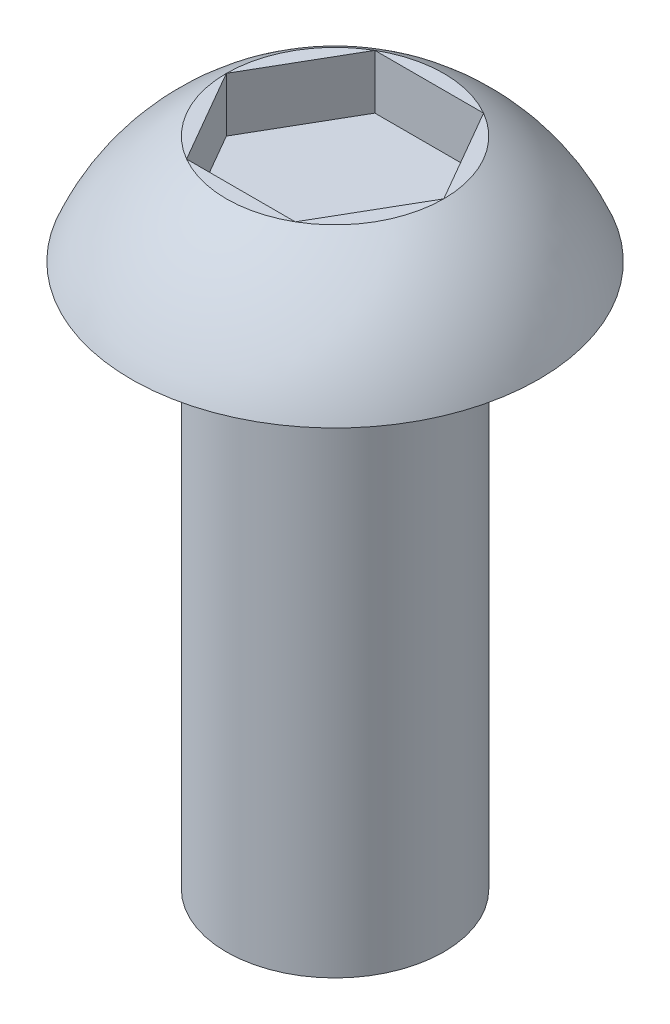
ISO-10303-21;
HEADER;
FILE_DESCRIPTION(('STEP AP214'),'2;1');
FILE_NAME('part.step','',(''),(''),'','','');
FILE_SCHEMA(('AUTOMOTIVE_DESIGN { 1 0 10303 214 1 1 1 1 }'));
ENDSEC;
DATA;
#1=APPLICATION_CONTEXT('core data for automotive mechanical design processes');
#2=APPLICATION_PROTOCOL_DEFINITION('international standard','automotive_design',2000,#1);
#3=PRODUCT_CONTEXT('',#1,'mechanical');
#4=PRODUCT('Part','Part','',(#3));
#5=PRODUCT_RELATED_PRODUCT_CATEGORY('part','',(#4));
#6=PRODUCT_DEFINITION_FORMATION('','',#4);
#7=PRODUCT_DEFINITION_CONTEXT('part definition',#1,'design');
#8=PRODUCT_DEFINITION('design','',#6,#7);
#9=PRODUCT_DEFINITION_SHAPE('','',#8);
#10=(LENGTH_UNIT() NAMED_UNIT(*) SI_UNIT(.MILLI.,.METRE.));
#11=(NAMED_UNIT(*) PLANE_ANGLE_UNIT() SI_UNIT($,.RADIAN.));
#12=(NAMED_UNIT(*) SI_UNIT($,.STERADIAN.) SOLID_ANGLE_UNIT());
#13=UNCERTAINTY_MEASURE_WITH_UNIT(LENGTH_MEASURE(1.E-05),#10,'distance_accuracy_value','');
#14=(GEOMETRIC_REPRESENTATION_CONTEXT(3) GLOBAL_UNCERTAINTY_ASSIGNED_CONTEXT((#13)) GLOBAL_UNIT_ASSIGNED_CONTEXT((#10,
#11,#12)) REPRESENTATION_CONTEXT('',''));
#15=CARTESIAN_POINT('',(0.,0.,0.));
#16=DIRECTION('',(0.,0.,1.));
#17=DIRECTION('',(1.,0.,0.));
#18=AXIS2_PLACEMENT_3D('',#15,#16,#17);
#19=CARTESIAN_POINT('',(0.,12.,0.));
#20=DIRECTION('',(0.,1.,0.));
#21=DIRECTION('',(-1.,0.,0.));
#22=AXIS2_PLACEMENT_3D('',#19,#20,#21);
#23=PLANE('',#22);
#24=DIRECTION('',(0.5,0.,-0.866025403784439));
#25=VECTOR('',#24,1.);
#26=CARTESIAN_POINT('',(0.99999999999998,12.,1.73205080756891));
#27=LINE('',#26,#25);
#28=CARTESIAN_POINT('',(0.99999999999998,12.,1.73205080756891));
#29=VERTEX_POINT('',#28);
#30=CARTESIAN_POINT('',(2.,12.,0.));
#31=VERTEX_POINT('',#30);
#32=EDGE_CURVE('E48',#29,#31,#27,.T.);
#33=ORIENTED_EDGE('',*,*,#32,.F.);
#34=CARTESIAN_POINT('',(0.,12.,0.));
#35=DIRECTION('',(0.,-1.,0.));
#36=DIRECTION('',(1.,0.,0.));
#37=AXIS2_PLACEMENT_3D('',#34,#35,#36);
#38=CIRCLE('',#37,2.00000000000004);
#39=EDGE_CURVE('E11',#31,#29,#38,.T.);
#40=ORIENTED_EDGE('',*,*,#39,.F.);
#41=EDGE_LOOP('',(#33,#40));
#42=FACE_BOUND('',#41,.T.);
#43=ADVANCED_FACE('F32',(#42),#23,.T.);
#44=DIRECTION('',(1.,0.,0.));
#45=VECTOR('',#44,1.);
#46=CARTESIAN_POINT('',(-1.00000000000006,12.,1.73205080756891));
#47=LINE('',#46,#45);
#48=CARTESIAN_POINT('',(-1.00000000000006,12.,1.73205080756891));
#49=VERTEX_POINT('',#48);
#50=EDGE_CURVE('E131',#49,#29,#47,.T.);
#51=ORIENTED_EDGE('',*,*,#50,.F.);
#52=EDGE_CURVE('E40',#29,#49,#38,.T.);
#53=ORIENTED_EDGE('',*,*,#52,.F.);
#54=EDGE_LOOP('',(#51,#53));
#55=FACE_BOUND('',#54,.T.);
#56=ADVANCED_FACE('F168',(#55),#23,.T.);
#57=DIRECTION('',(0.5,0.,0.866025403784439));
#58=VECTOR('',#57,1.);
#59=CARTESIAN_POINT('',(-2.00000000000008,12.,0.));
#60=LINE('',#59,#58);
#61=CARTESIAN_POINT('',(-2.00000000000008,12.,0.));
#62=VERTEX_POINT('',#61);
#63=EDGE_CURVE('E129',#62,#49,#60,.T.);
#64=ORIENTED_EDGE('',*,*,#63,.F.);
#65=EDGE_CURVE('E158',#49,#62,#38,.T.);
#66=ORIENTED_EDGE('',*,*,#65,.F.);
#67=EDGE_LOOP('',(#64,#66));
#68=FACE_BOUND('',#67,.T.);
#69=ADVANCED_FACE('F170',(#68),#23,.T.);
#70=DIRECTION('',(-0.5,0.,0.866025403784439));
#71=VECTOR('',#70,1.);
#72=CARTESIAN_POINT('',(-1.00000000000006,12.,-1.73205080756891));
#73=LINE('',#72,#71);
#74=CARTESIAN_POINT('',(-1.00000000000006,12.,-1.73205080756891));
#75=VERTEX_POINT('',#74);
#76=EDGE_CURVE('E96',#75,#62,#73,.T.);
#77=ORIENTED_EDGE('',*,*,#76,.F.);
#78=EDGE_CURVE('E155',#62,#75,#38,.T.);
#79=ORIENTED_EDGE('',*,*,#78,.F.);
#80=EDGE_LOOP('',(#77,#79));
#81=FACE_BOUND('',#80,.T.);
#82=ADVANCED_FACE('F172',(#81),#23,.T.);
#83=DIRECTION('',(-1.,0.,0.));
#84=VECTOR('',#83,1.);
#85=CARTESIAN_POINT('',(0.999999999999979,12.,-1.73205080756891));
#86=LINE('',#85,#84);
#87=CARTESIAN_POINT('',(0.999999999999979,12.,-1.73205080756891));
#88=VERTEX_POINT('',#87);
#89=EDGE_CURVE('E125',#88,#75,#86,.T.);
#90=ORIENTED_EDGE('',*,*,#89,.F.);
#91=EDGE_CURVE('E150',#75,#88,#38,.T.);
#92=ORIENTED_EDGE('',*,*,#91,.F.);
#93=EDGE_LOOP('',(#90,#92));
#94=FACE_BOUND('',#93,.T.);
#95=ADVANCED_FACE('F175',(#94),#23,.T.);
#96=DIRECTION('',(-0.5,0.,-0.866025403784439));
#97=VECTOR('',#96,1.);
#98=CARTESIAN_POINT('',(2.,12.,0.));
#99=LINE('',#98,#97);
#100=EDGE_CURVE('E122',#31,#88,#99,.T.);
#101=ORIENTED_EDGE('',*,*,#100,.F.);
#102=EDGE_CURVE('E41',#88,#31,#38,.T.);
#103=ORIENTED_EDGE('',*,*,#102,.F.);
#104=EDGE_LOOP('',(#101,#103));
#105=FACE_BOUND('',#104,.T.);
#106=ADVANCED_FACE('F34',(#105),#23,.T.);
#107=CARTESIAN_POINT('',(0.,8.48437500000001,0.));
#108=DIRECTION('',(0.,-1.,0.));
#109=DIRECTION('',(1.,0.,0.));
#110=AXIS2_PLACEMENT_3D('',#107,#108,#109);
#111=SPHERICAL_SURFACE('',#110,4.04470260224717);
#112=ORIENTED_EDGE('',*,*,#39,.T.);
#113=ORIENTED_EDGE('',*,*,#52,.T.);
#114=ORIENTED_EDGE('',*,*,#65,.T.);
#115=ORIENTED_EDGE('',*,*,#78,.T.);
#116=ORIENTED_EDGE('',*,*,#91,.T.);
#117=ORIENTED_EDGE('',*,*,#102,.T.);
#118=EDGE_LOOP('',(#112,#113,#114,#115,#116,#117));
#119=FACE_BOUND('',#118,.T.);
#120=CARTESIAN_POINT('',(0.,10.,0.));
#121=DIRECTION('',(0.,-1.,0.));
#122=DIRECTION('',(1.,0.,0.));
#123=AXIS2_PLACEMENT_3D('',#120,#121,#122);
#124=CIRCLE('',#123,3.75000000000003);
#125=CARTESIAN_POINT('',(3.75,10.,0.));
#126=VERTEX_POINT('',#125);
#127=EDGE_CURVE('E145',#126,#126,#124,.T.);
#128=ORIENTED_EDGE('',*,*,#127,.F.);
#129=EDGE_LOOP('',(#128));
#130=FACE_BOUND('',#129,.T.);
#131=ADVANCED_FACE('F164',(#119,#130),#111,.T.);
#132=CARTESIAN_POINT('',(2.,10.,0.));
#133=DIRECTION('',(0.,-1.,0.));
#134=DIRECTION('',(1.,0.,0.));
#135=AXIS2_PLACEMENT_3D('',#132,#133,#134);
#136=PLANE('',#135);
#137=ORIENTED_EDGE('',*,*,#127,.T.);
#138=EDGE_LOOP('',(#137));
#139=FACE_BOUND('',#138,.T.);
#140=CARTESIAN_POINT('',(0.,10.,0.));
#141=DIRECTION('',(0.,-1.,0.));
#142=DIRECTION('',(1.,0.,0.));
#143=AXIS2_PLACEMENT_3D('',#140,#141,#142);
#144=CIRCLE('',#143,2.00000000000003);
#145=CARTESIAN_POINT('',(2.,10.,0.));
#146=VERTEX_POINT('',#145);
#147=EDGE_CURVE('E143',#146,#146,#144,.T.);
#148=ORIENTED_EDGE('',*,*,#147,.F.);
#149=EDGE_LOOP('',(#148));
#150=FACE_BOUND('',#149,.T.);
#151=ADVANCED_FACE('F206',(#139,#150),#136,.T.);
#152=CARTESIAN_POINT('',(1.064083484603E-12,-310.205901947247,0.));
#153=DIRECTION('',(0.,-1.,0.));
#154=DIRECTION('',(1.,0.,0.));
#155=AXIS2_PLACEMENT_3D('',#152,#153,#154);
#156=CYLINDRICAL_SURFACE('',#155,2.00000000000001);
#157=ORIENTED_EDGE('',*,*,#147,.T.);
#158=EDGE_LOOP('',(#157));
#159=FACE_BOUND('',#158,.T.);
#160=CARTESIAN_POINT('',(0.,0.,0.));
#161=DIRECTION('',(0.,-1.,0.));
#162=DIRECTION('',(1.,0.,0.));
#163=AXIS2_PLACEMENT_3D('',#160,#161,#162);
#164=CIRCLE('',#163,1.99999999999999);
#165=CARTESIAN_POINT('',(1.99999999999999,0.,0.));
#166=VERTEX_POINT('',#165);
#167=EDGE_CURVE('E135',#166,#166,#164,.T.);
#168=ORIENTED_EDGE('',*,*,#167,.F.);
#169=EDGE_LOOP('',(#168));
#170=FACE_BOUND('',#169,.T.);
#171=ADVANCED_FACE('F192',(#159,#170),#156,.T.);
#172=CARTESIAN_POINT('',(0.,0.,0.));
#173=DIRECTION('',(0.,-1.,0.));
#174=DIRECTION('',(1.,0.,0.));
#175=AXIS2_PLACEMENT_3D('',#172,#173,#174);
#176=PLANE('',#175);
#177=ORIENTED_EDGE('',*,*,#167,.T.);
#178=EDGE_LOOP('',(#177));
#179=FACE_BOUND('',#178,.T.);
#180=ADVANCED_FACE('F185',(#179),#176,.T.);
#181=CARTESIAN_POINT('',(0.999999999999983,11.,1.73205080756891));
#182=DIRECTION('',(0.866025403784439,0.,0.5));
#183=DIRECTION('',(0.5,0.,-0.866025403784439));
#184=AXIS2_PLACEMENT_3D('',#181,#182,#183);
#185=PLANE('',#184);
#186=ORIENTED_EDGE('',*,*,#32,.T.);
#187=DIRECTION('',(0.,1.,0.));
#188=VECTOR('',#187,1.);
#189=CARTESIAN_POINT('',(2.,11.,0.));
#190=LINE('',#189,#188);
#191=CARTESIAN_POINT('',(2.,11.,0.));
#192=VERTEX_POINT('',#191);
#193=EDGE_CURVE('E78',#192,#31,#190,.T.);
#194=ORIENTED_EDGE('',*,*,#193,.F.);
#195=DIRECTION('',(0.5,0.,-0.866025403784439));
#196=VECTOR('',#195,1.);
#197=CARTESIAN_POINT('',(0.999999999999983,11.,1.73205080756891));
#198=LINE('',#197,#196);
#199=CARTESIAN_POINT('',(0.999999999999983,11.,1.73205080756891));
#200=VERTEX_POINT('',#199);
#201=EDGE_CURVE('E133',#200,#192,#198,.T.);
#202=ORIENTED_EDGE('',*,*,#201,.F.);
#203=DIRECTION('',(0.,1.,0.));
#204=VECTOR('',#203,1.);
#205=CARTESIAN_POINT('',(0.999999999999983,11.,1.73205080756891));
#206=LINE('',#205,#204);
#207=EDGE_CURVE('E56',#200,#29,#206,.T.);
#208=ORIENTED_EDGE('',*,*,#207,.T.);
#209=EDGE_LOOP('',(#186,#194,#202,#208));
#210=FACE_BOUND('',#209,.T.);
#211=ADVANCED_FACE('F182',(#210),#185,.F.);
#212=CARTESIAN_POINT('',(-1.00000000000006,11.,1.73205080756891));
#213=DIRECTION('',(0.,0.,1.));
#214=DIRECTION('',(1.,0.,0.));
#215=AXIS2_PLACEMENT_3D('',#212,#213,#214);
#216=PLANE('',#215);
#217=ORIENTED_EDGE('',*,*,#50,.T.);
#218=ORIENTED_EDGE('',*,*,#207,.F.);
#219=DIRECTION('',(1.,0.,0.));
#220=VECTOR('',#219,1.);
#221=CARTESIAN_POINT('',(-1.00000000000006,11.,1.73205080756891));
#222=LINE('',#221,#220);
#223=CARTESIAN_POINT('',(-1.00000000000006,11.,1.73205080756891));
#224=VERTEX_POINT('',#223);
#225=EDGE_CURVE('E108',#224,#200,#222,.T.);
#226=ORIENTED_EDGE('',*,*,#225,.F.);
#227=DIRECTION('',(0.,1.,0.));
#228=VECTOR('',#227,1.);
#229=CARTESIAN_POINT('',(-1.00000000000006,11.,1.73205080756891));
#230=LINE('',#229,#228);
#231=EDGE_CURVE('E100',#224,#49,#230,.T.);
#232=ORIENTED_EDGE('',*,*,#231,.T.);
#233=EDGE_LOOP('',(#217,#218,#226,#232));
#234=FACE_BOUND('',#233,.T.);
#235=ADVANCED_FACE('F184',(#234),#216,.F.);
#236=CARTESIAN_POINT('',(-2.00000000000008,11.,0.));
#237=DIRECTION('',(-0.866025403784439,0.,0.5));
#238=DIRECTION('',(0.5,0.,0.866025403784439));
#239=AXIS2_PLACEMENT_3D('',#236,#237,#238);
#240=PLANE('',#239);
#241=ORIENTED_EDGE('',*,*,#63,.T.);
#242=ORIENTED_EDGE('',*,*,#231,.F.);
#243=DIRECTION('',(0.5,0.,0.866025403784439));
#244=VECTOR('',#243,1.);
#245=CARTESIAN_POINT('',(-2.00000000000008,11.,0.));
#246=LINE('',#245,#244);
#247=CARTESIAN_POINT('',(-2.00000000000008,11.,0.));
#248=VERTEX_POINT('',#247);
#249=EDGE_CURVE('E104',#248,#224,#246,.T.);
#250=ORIENTED_EDGE('',*,*,#249,.F.);
#251=DIRECTION('',(0.,1.,0.));
#252=VECTOR('',#251,1.);
#253=CARTESIAN_POINT('',(-2.00000000000008,11.,0.));
#254=LINE('',#253,#252);
#255=EDGE_CURVE('E89',#248,#62,#254,.T.);
#256=ORIENTED_EDGE('',*,*,#255,.T.);
#257=EDGE_LOOP('',(#241,#242,#250,#256));
#258=FACE_BOUND('',#257,.T.);
#259=ADVANCED_FACE('F105',(#258),#240,.F.);
#260=CARTESIAN_POINT('',(-1.00000000000006,11.,-1.73205080756891));
#261=DIRECTION('',(-0.866025403784439,0.,-0.5));
#262=DIRECTION('',(-0.5,0.,0.866025403784439));
#263=AXIS2_PLACEMENT_3D('',#260,#261,#262);
#264=PLANE('',#263);
#265=ORIENTED_EDGE('',*,*,#76,.T.);
#266=ORIENTED_EDGE('',*,*,#255,.F.);
#267=DIRECTION('',(-0.5,0.,0.866025403784439));
#268=VECTOR('',#267,1.);
#269=CARTESIAN_POINT('',(-1.00000000000006,11.,-1.73205080756891));
#270=LINE('',#269,#268);
#271=CARTESIAN_POINT('',(-1.00000000000006,11.,-1.73205080756891));
#272=VERTEX_POINT('',#271);
#273=EDGE_CURVE('E93',#272,#248,#270,.T.);
#274=ORIENTED_EDGE('',*,*,#273,.F.);
#275=DIRECTION('',(0.,1.,0.));
#276=VECTOR('',#275,1.);
#277=CARTESIAN_POINT('',(-1.00000000000006,11.,-1.73205080756891));
#278=LINE('',#277,#276);
#279=EDGE_CURVE('E101',#272,#75,#278,.T.);
#280=ORIENTED_EDGE('',*,*,#279,.T.);
#281=EDGE_LOOP('',(#265,#266,#274,#280));
#282=FACE_BOUND('',#281,.T.);
#283=ADVANCED_FACE('F91',(#282),#264,.F.);
#284=CARTESIAN_POINT('',(0.999999999999983,11.,-1.73205080756891));
#285=DIRECTION('',(0.,0.,-1.));
#286=DIRECTION('',(-1.,0.,0.));
#287=AXIS2_PLACEMENT_3D('',#284,#285,#286);
#288=PLANE('',#287);
#289=ORIENTED_EDGE('',*,*,#89,.T.);
#290=ORIENTED_EDGE('',*,*,#279,.F.);
#291=DIRECTION('',(-1.,0.,0.));
#292=VECTOR('',#291,1.);
#293=CARTESIAN_POINT('',(0.999999999999983,11.,-1.73205080756891));
#294=LINE('',#293,#292);
#295=CARTESIAN_POINT('',(0.999999999999983,11.,-1.73205080756891));
#296=VERTEX_POINT('',#295);
#297=EDGE_CURVE('E114',#296,#272,#294,.T.);
#298=ORIENTED_EDGE('',*,*,#297,.F.);
#299=DIRECTION('',(0.,1.,0.));
#300=VECTOR('',#299,1.);
#301=CARTESIAN_POINT('',(0.999999999999983,11.,-1.73205080756891));
#302=LINE('',#301,#300);
#303=EDGE_CURVE('E138',#296,#88,#302,.T.);
#304=ORIENTED_EDGE('',*,*,#303,.T.);
#305=EDGE_LOOP('',(#289,#290,#298,#304));
#306=FACE_BOUND('',#305,.T.);
#307=ADVANCED_FACE('F282',(#306),#288,.F.);
#308=CARTESIAN_POINT('',(2.,11.,0.));
#309=DIRECTION('',(0.866025403784439,0.,-0.5));
#310=DIRECTION('',(-0.5,0.,-0.866025403784439));
#311=AXIS2_PLACEMENT_3D('',#308,#309,#310);
#312=PLANE('',#311);
#313=ORIENTED_EDGE('',*,*,#100,.T.);
#314=ORIENTED_EDGE('',*,*,#303,.F.);
#315=DIRECTION('',(-0.5,0.,-0.866025403784439));
#316=VECTOR('',#315,1.);
#317=CARTESIAN_POINT('',(2.,11.,0.));
#318=LINE('',#317,#316);
#319=EDGE_CURVE('E116',#192,#296,#318,.T.);
#320=ORIENTED_EDGE('',*,*,#319,.F.);
#321=ORIENTED_EDGE('',*,*,#193,.T.);
#322=EDGE_LOOP('',(#313,#314,#320,#321));
#323=FACE_BOUND('',#322,.T.);
#324=ADVANCED_FACE('F180',(#323),#312,.F.);
#325=CARTESIAN_POINT('',(0.,11.,0.));
#326=DIRECTION('',(0.,1.,0.));
#327=DIRECTION('',(-1.,0.,0.));
#328=AXIS2_PLACEMENT_3D('',#325,#326,#327);
#329=PLANE('',#328);
#330=ORIENTED_EDGE('',*,*,#201,.T.);
#331=ORIENTED_EDGE('',*,*,#319,.T.);
#332=ORIENTED_EDGE('',*,*,#297,.T.);
#333=ORIENTED_EDGE('',*,*,#273,.T.);
#334=ORIENTED_EDGE('',*,*,#249,.T.);
#335=ORIENTED_EDGE('',*,*,#225,.T.);
#336=EDGE_LOOP('',(#330,#331,#332,#333,#334,#335));
#337=FACE_BOUND('',#336,.T.);
#338=ADVANCED_FACE('F111',(#337),#329,.T.);
#339=CLOSED_SHELL('',(#43,#56,#69,#82,#95,#106,#131,#151,#171,#180,#211,#235,#259,#283,#307,
#324,#338));
#340=MANIFOLD_SOLID_BREP('B2',#339);
#341=ADVANCED_BREP_SHAPE_REPRESENTATION('',(#18,#340),#14);
#342=SHAPE_DEFINITION_REPRESENTATION(#9,#341);
ENDSEC;
END-ISO-10303-21;
